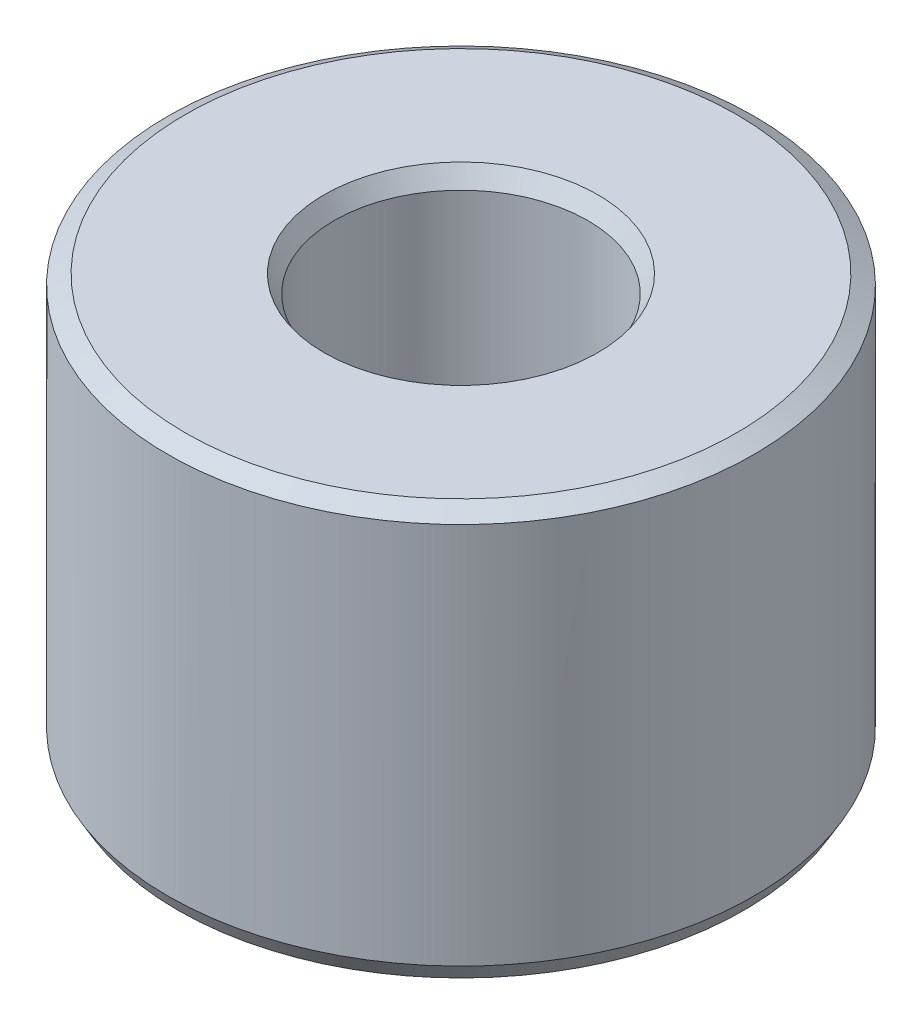
ISO-10303-21;
HEADER;
FILE_DESCRIPTION(('STEP AP214'),'2;1');
FILE_NAME('part.step','',(''),(''),'','','');
FILE_SCHEMA(('AUTOMOTIVE_DESIGN { 1 0 10303 214 1 1 1 1 }'));
ENDSEC;
DATA;
#1=APPLICATION_CONTEXT('core data for automotive mechanical design processes');
#2=APPLICATION_PROTOCOL_DEFINITION('international standard','automotive_design',2000,#1);
#3=PRODUCT_CONTEXT('',#1,'mechanical');
#4=PRODUCT('Part','Part','',(#3));
#5=PRODUCT_RELATED_PRODUCT_CATEGORY('part','',(#4));
#6=PRODUCT_DEFINITION_FORMATION('','',#4);
#7=PRODUCT_DEFINITION_CONTEXT('part definition',#1,'design');
#8=PRODUCT_DEFINITION('design','',#6,#7);
#9=PRODUCT_DEFINITION_SHAPE('','',#8);
#10=(LENGTH_UNIT() NAMED_UNIT(*) SI_UNIT(.MILLI.,.METRE.));
#11=(NAMED_UNIT(*) PLANE_ANGLE_UNIT() SI_UNIT($,.RADIAN.));
#12=(NAMED_UNIT(*) SI_UNIT($,.STERADIAN.) SOLID_ANGLE_UNIT());
#13=UNCERTAINTY_MEASURE_WITH_UNIT(LENGTH_MEASURE(1.E-05),#10,'distance_accuracy_value','');
#14=(GEOMETRIC_REPRESENTATION_CONTEXT(3) GLOBAL_UNCERTAINTY_ASSIGNED_CONTEXT((#13)) GLOBAL_UNIT_ASSIGNED_CONTEXT((#10,
#11,#12)) REPRESENTATION_CONTEXT('',''));
#15=CARTESIAN_POINT('',(0.,0.,0.));
#16=DIRECTION('',(0.,0.,1.));
#17=DIRECTION('',(1.,0.,0.));
#18=AXIS2_PLACEMENT_3D('',#15,#16,#17);
#19=CARTESIAN_POINT('',(0.,76.9031995801441,0.));
#20=DIRECTION('',(0.,-1.,0.));
#21=DIRECTION('',(0.,0.,-1.));
#22=AXIS2_PLACEMENT_3D('',#19,#20,#21);
#23=CYLINDRICAL_SURFACE('',#22,55.);
#24=CARTESIAN_POINT('',(0.,3.25785083386025,0.));
#25=DIRECTION('',(0.,1.,0.));
#26=DIRECTION('',(0.,0.,1.));
#27=AXIS2_PLACEMENT_3D('',#24,#25,#26);
#28=CIRCLE('',#27,55.);
#29=CARTESIAN_POINT('',(0.,3.25785083386025,55.));
#30=VERTEX_POINT('',#29);
#31=EDGE_CURVE('E10',#30,#30,#28,.T.);
#32=ORIENTED_EDGE('',*,*,#31,.T.);
#33=EDGE_LOOP('',(#32));
#34=FACE_BOUND('',#33,.T.);
#35=CARTESIAN_POINT('',(0.,75.0222785242352,0.));
#36=DIRECTION('',(0.,1.,0.));
#37=DIRECTION('',(0.,0.,1.));
#38=AXIS2_PLACEMENT_3D('',#35,#36,#37);
#39=CIRCLE('',#38,55.);
#40=CARTESIAN_POINT('',(0.,75.0222785242352,-55.));
#41=VERTEX_POINT('',#40);
#42=EDGE_CURVE('E50',#41,#41,#39,.F.);
#43=ORIENTED_EDGE('',*,*,#42,.T.);
#44=EDGE_LOOP('',(#43));
#45=FACE_BOUND('',#44,.T.);
#46=ADVANCED_FACE('F39',(#34,#45),#23,.T.);
#47=CARTESIAN_POINT('',(0.,76.9031995801441,0.));
#48=DIRECTION('',(0.,1.,0.));
#49=DIRECTION('',(0.,0.,1.));
#50=AXIS2_PLACEMENT_3D('',#47,#48,#49);
#51=PLANE('',#50);
#52=CARTESIAN_POINT('',(0.,76.9031995801441,0.));
#53=DIRECTION('',(0.,1.,0.));
#54=DIRECTION('',(0.,0.,1.));
#55=AXIS2_PLACEMENT_3D('',#52,#53,#54);
#56=CIRCLE('',#55,25.6864381851244);
#57=CARTESIAN_POINT('',(0.,76.9031995801441,25.6864381851244));
#58=VERTEX_POINT('',#57);
#59=EDGE_CURVE('E58',#58,#58,#56,.F.);
#60=ORIENTED_EDGE('',*,*,#59,.T.);
#61=EDGE_LOOP('',(#60));
#62=FACE_BOUND('',#61,.T.);
#63=CARTESIAN_POINT('',(0.,76.9031995801441,0.));
#64=DIRECTION('',(0.,1.,0.));
#65=DIRECTION('',(0.,0.,1.));
#66=AXIS2_PLACEMENT_3D('',#63,#64,#65);
#67=CIRCLE('',#66,51.7421491661397);
#68=CARTESIAN_POINT('',(0.,76.9031995801441,-51.7421491661397));
#69=VERTEX_POINT('',#68);
#70=EDGE_CURVE('E61',#69,#69,#67,.T.);
#71=ORIENTED_EDGE('',*,*,#70,.T.);
#72=EDGE_LOOP('',(#71));
#73=FACE_BOUND('',#72,.T.);
#74=ADVANCED_FACE('F88',(#62,#73),#51,.T.);
#75=CARTESIAN_POINT('',(0.,0.,0.));
#76=DIRECTION('',(0.,1.,0.));
#77=DIRECTION('',(0.,0.,1.));
#78=AXIS2_PLACEMENT_3D('',#75,#76,#77);
#79=PLANE('',#78);
#80=CARTESIAN_POINT('',(0.,0.,0.));
#81=DIRECTION('',(0.,1.,0.));
#82=DIRECTION('',(0.,0.,1.));
#83=AXIS2_PLACEMENT_3D('',#80,#81,#82);
#84=CIRCLE('',#83,27.0633679630758);
#85=CARTESIAN_POINT('',(0.,0.,-27.0633679630758));
#86=VERTEX_POINT('',#85);
#87=EDGE_CURVE('E51',#86,#86,#84,.T.);
#88=ORIENTED_EDGE('',*,*,#87,.T.);
#89=EDGE_LOOP('',(#88));
#90=FACE_BOUND('',#89,.T.);
#91=CARTESIAN_POINT('',(0.,0.,0.));
#92=DIRECTION('',(0.,1.,0.));
#93=DIRECTION('',(0.,0.,1.));
#94=AXIS2_PLACEMENT_3D('',#91,#92,#93);
#95=CIRCLE('',#94,53.1190789440911);
#96=CARTESIAN_POINT('',(0.,0.,53.1190789440911));
#97=VERTEX_POINT('',#96);
#98=EDGE_CURVE('E54',#97,#97,#95,.F.);
#99=ORIENTED_EDGE('',*,*,#98,.T.);
#100=EDGE_LOOP('',(#99));
#101=FACE_BOUND('',#100,.T.);
#102=ADVANCED_FACE('F83',(#90,#101),#79,.F.);
#103=CARTESIAN_POINT('',(0.,76.9031995801441,0.));
#104=DIRECTION('',(0.,-1.,0.));
#105=DIRECTION('',(0.,0.,-1.));
#106=AXIS2_PLACEMENT_3D('',#103,#104,#105);
#107=CYLINDRICAL_SURFACE('',#106,23.8055171292155);
#108=CARTESIAN_POINT('',(0.,73.6453487462838,0.));
#109=DIRECTION('',(0.,1.,0.));
#110=DIRECTION('',(0.,0.,1.));
#111=AXIS2_PLACEMENT_3D('',#108,#109,#110);
#112=CIRCLE('',#111,23.8055171292155);
#113=CARTESIAN_POINT('',(0.,73.6453487462838,23.8055171292155));
#114=VERTEX_POINT('',#113);
#115=EDGE_CURVE('E67',#114,#114,#112,.T.);
#116=ORIENTED_EDGE('',*,*,#115,.T.);
#117=EDGE_LOOP('',(#116));
#118=FACE_BOUND('',#117,.T.);
#119=CARTESIAN_POINT('',(0.,1.8809210559089,0.));
#120=DIRECTION('',(0.,1.,0.));
#121=DIRECTION('',(0.,0.,1.));
#122=AXIS2_PLACEMENT_3D('',#119,#120,#121);
#123=CIRCLE('',#122,23.8055171292155);
#124=CARTESIAN_POINT('',(0.,1.8809210559089,-23.8055171292155));
#125=VERTEX_POINT('',#124);
#126=EDGE_CURVE('E69',#125,#125,#123,.F.);
#127=ORIENTED_EDGE('',*,*,#126,.T.);
#128=EDGE_LOOP('',(#127));
#129=FACE_BOUND('',#128,.T.);
#130=ADVANCED_FACE('F71',(#118,#129),#107,.F.);
#131=CARTESIAN_POINT('',(0.,73.6453487462838,0.));
#132=DIRECTION('',(0.,1.,0.));
#133=DIRECTION('',(0.,0.,1.));
#134=AXIS2_PLACEMENT_3D('',#131,#132,#133);
#135=CONICAL_SURFACE('',#134,23.8055171292155,0.5235987755983);
#136=ORIENTED_EDGE('',*,*,#59,.F.);
#137=EDGE_LOOP('',(#136));
#138=FACE_BOUND('',#137,.T.);
#139=ORIENTED_EDGE('',*,*,#115,.F.);
#140=EDGE_LOOP('',(#139));
#141=FACE_BOUND('',#140,.T.);
#142=ADVANCED_FACE('F77',(#138,#141),#135,.F.);
#143=CARTESIAN_POINT('',(0.,0.,0.));
#144=DIRECTION('',(0.,-1.,0.));
#145=DIRECTION('',(0.,0.,-1.));
#146=AXIS2_PLACEMENT_3D('',#143,#144,#145);
#147=CONICAL_SURFACE('',#146,27.0633679630758,1.04719755119659);
#148=CARTESIAN_POINT('',(0.,1.8809210559089,-23.8055171292155));
#149=CARTESIAN_POINT('',(0.,1.86132812824318,-23.8394530754016));
#150=CARTESIAN_POINT('',(0.,1.84173520057746,-23.8733890215876));
#151=CARTESIAN_POINT('',(0.,1.80254934524603,-23.9412609139597));
#152=CARTESIAN_POINT('',(0.,1.78295641758031,-23.9751968601458));
#153=CARTESIAN_POINT('',(0.,1.74377056224887,-24.0430687525178));
#154=CARTESIAN_POINT('',(0.,1.72417763458315,-24.0770046987039));
#155=CARTESIAN_POINT('',(0.,1.68499177925172,-24.144876591076));
#156=CARTESIAN_POINT('',(0.,1.665398851586,-24.178812537262));
#157=CARTESIAN_POINT('',(0.,1.62621299625457,-24.2466844296341));
#158=CARTESIAN_POINT('',(0.,1.60662006858885,-24.2806203758201));
#159=CARTESIAN_POINT('',(0.,1.56743421325741,-24.3484922681922));
#160=CARTESIAN_POINT('',(0.,1.5478412855917,-24.3824282143783));
#161=CARTESIAN_POINT('',(0.,1.50865543026026,-24.4503001067504));
#162=CARTESIAN_POINT('',(0.,1.48906250259454,-24.4842360529364));
#163=CARTESIAN_POINT('',(0.,1.44987664726311,-24.5521079453085));
#164=CARTESIAN_POINT('',(0.,1.43028371959739,-24.5860438914946));
#165=CARTESIAN_POINT('',(0.,1.39109786426595,-24.6539157838666));
#166=CARTESIAN_POINT('',(0.,1.37150493660024,-24.6878517300527));
#167=CARTESIAN_POINT('',(0.,1.3323190812688,-24.7557236224248));
#168=CARTESIAN_POINT('',(0.,1.31272615360308,-24.7896595686108));
#169=CARTESIAN_POINT('',(0.,1.27354029827165,-24.8575314609829));
#170=CARTESIAN_POINT('',(0.,1.25394737060593,-24.8914674071689));
#171=CARTESIAN_POINT('',(0.,1.21476151527449,-24.959339299541));
#172=CARTESIAN_POINT('',(0.,1.19516858760878,-24.9932752457271));
#173=CARTESIAN_POINT('',(0.,1.15598273227734,-25.0611471380992));
#174=CARTESIAN_POINT('',(0.,1.13638980461162,-25.0950830842852));
#175=CARTESIAN_POINT('',(0.,1.09720394928019,-25.1629549766573));
#176=CARTESIAN_POINT('',(0.,1.07761102161447,-25.1968909228433));
#177=CARTESIAN_POINT('',(0.,1.03842516628304,-25.2647628152154));
#178=CARTESIAN_POINT('',(0.,1.01883223861732,-25.2986987614015));
#179=CARTESIAN_POINT('',(0.,0.979646383285883,-25.3665706537736));
#180=CARTESIAN_POINT('',(0.,0.960053455620166,-25.4005065999596));
#181=CARTESIAN_POINT('',(0.,0.920867600288731,-25.4683784923317));
#182=CARTESIAN_POINT('',(0.,0.901274672623013,-25.5023144385177));
#183=CARTESIAN_POINT('',(0.,0.862088817291577,-25.5701863308898));
#184=CARTESIAN_POINT('',(0.,0.84249588962586,-25.6041222770759));
#185=CARTESIAN_POINT('',(0.,0.803310034294425,-25.671994169448));
#186=CARTESIAN_POINT('',(0.,0.783717106628707,-25.705930115634));
#187=CARTESIAN_POINT('',(0.,0.744531251297271,-25.7738020080061));
#188=CARTESIAN_POINT('',(0.,0.724938323631553,-25.8077379541921));
#189=CARTESIAN_POINT('',(0.,0.685752468300118,-25.8756098465642));
#190=CARTESIAN_POINT('',(0.,0.666159540634401,-25.9095457927503));
#191=CARTESIAN_POINT('',(0.,0.626973685302965,-25.9774176851224));
#192=CARTESIAN_POINT('',(0.,0.607380757637247,-26.0113536313084));
#193=CARTESIAN_POINT('',(0.,0.568194902305812,-26.0792255236805));
#194=CARTESIAN_POINT('',(0.,0.548601974640095,-26.1131614698665));
#195=CARTESIAN_POINT('',(0.,0.50941611930866,-26.1810333622386));
#196=CARTESIAN_POINT('',(0.,0.489823191642941,-26.2149693084247));
#197=CARTESIAN_POINT('',(0.,0.450637336311506,-26.2828412007968));
#198=CARTESIAN_POINT('',(0.,0.431044408645789,-26.3167771469828));
#199=CARTESIAN_POINT('',(0.,0.391858553314354,-26.3846490393549));
#200=CARTESIAN_POINT('',(0.,0.372265625648635,-26.4185849855409));
#201=CARTESIAN_POINT('',(0.,0.3330797703172,-26.486456877913));
#202=CARTESIAN_POINT('',(0.,0.313486842651483,-26.5203928240991));
#203=CARTESIAN_POINT('',(0.,0.274300987320048,-26.5882647164712));
#204=CARTESIAN_POINT('',(0.,0.254708059654329,-26.6222006626572));
#205=CARTESIAN_POINT('',(0.,0.215522204322894,-26.6900725550293));
#206=CARTESIAN_POINT('',(0.,0.195929276657177,-26.7240085012153));
#207=CARTESIAN_POINT('',(0.,0.156743421325742,-26.7918803935874));
#208=CARTESIAN_POINT('',(0.,0.137150493660023,-26.8258163397735));
#209=CARTESIAN_POINT('',(0.,0.097964638328588,-26.8936882321456));
#210=CARTESIAN_POINT('',(0.,0.0783717106628706,-26.9276241783316));
#211=CARTESIAN_POINT('',(0.,0.0391858553314359,-26.9954960707037));
#212=CARTESIAN_POINT('',(0.,0.0195929276657185,-27.0294320168897));
#213=CARTESIAN_POINT('',(0.,0.,-27.0633679630758));
#214=B_SPLINE_CURVE_WITH_KNOTS('',3,(#148,#149,#150,#151,#152,#153,#154,#155,#156,#157,#158,
#159,#160,#161,#162,#163,#164,#165,#166,#167,#168,#169,#170,#171,#172,#173,#174,#175,#176,#177,
#178,#179,#180,#181,#182,#183,#184,#185,#186,#187,#188,#189,#190,#191,#192,#193,#194,#195,#196,
#197,#198,#199,#200,#201,#202,#203,#204,#205,#206,#207,#208,#209,#210,#211,#212,#213),
.UNSPECIFIED.,.F.,.F.,(4,2,2,2,2,2,2,2,2,2,2,2,2,2,2,2,2,2,2,2,2,2,2,2,2,2,2,2,2,2,2,2,4),(0.,
0.117557565994306,0.23511513198861,0.352672697982916,0.470230263977219,0.587787829971523,
0.705345395965829,0.822902961960132,0.940460527954439,1.05801809394874,1.17557565994305,
1.29313322593735,1.41069079193166,1.52824835792596,1.64580592392027,1.76336348991457,
1.88092105590888,1.99847862190318,2.11603618789749,2.23359375389179,2.35115131988609,
2.4687088858804,2.5862664518747,2.70382401786901,2.82138158386331,2.93893914985762,
3.05649671585192,3.17405428184623,3.29161184784053,3.40916941383484,3.52672697982914,
3.64428454582345,3.76184211181775),.UNSPECIFIED.);
#215=EDGE_CURVE('BSEAM73',#125,#86,#214,.T.);
#216=ORIENTED_EDGE('',*,*,#126,.F.);
#217=ORIENTED_EDGE('',*,*,#87,.F.);
#218=ORIENTED_EDGE('',*,*,#215,.T.);
#219=ORIENTED_EDGE('',*,*,#215,.F.);
#220=EDGE_LOOP('',(#216,#218,#217,#219));
#221=FACE_BOUND('',#220,.T.);
#222=ADVANCED_FACE('F73',(#221),#147,.F.);
#223=CARTESIAN_POINT('',(0.,3.25785083386025,0.));
#224=DIRECTION('',(0.,1.,0.));
#225=DIRECTION('',(0.,0.,1.));
#226=AXIS2_PLACEMENT_3D('',#223,#224,#225);
#227=CONICAL_SURFACE('',#226,55.,0.523598775598302);
#228=ORIENTED_EDGE('',*,*,#98,.F.);
#229=EDGE_LOOP('',(#228));
#230=FACE_BOUND('',#229,.T.);
#231=ORIENTED_EDGE('',*,*,#31,.F.);
#232=EDGE_LOOP('',(#231));
#233=FACE_BOUND('',#232,.T.);
#234=ADVANCED_FACE('F76',(#230,#233),#227,.T.);
#235=CARTESIAN_POINT('',(0.,76.9031995801441,0.));
#236=DIRECTION('',(0.,-1.,0.));
#237=DIRECTION('',(0.,0.,-1.));
#238=AXIS2_PLACEMENT_3D('',#235,#236,#237);
#239=CONICAL_SURFACE('',#238,51.7421491661397,1.04719755119659);
#240=CARTESIAN_POINT('',(0.,75.0222785242352,-55.));
#241=CARTESIAN_POINT('',(0.,75.0418714519009,-54.966064053814));
#242=CARTESIAN_POINT('',(0.,75.0614643795666,-54.9321281076279));
#243=CARTESIAN_POINT('',(0.,75.1006502348981,-54.8642562152558));
#244=CARTESIAN_POINT('',(0.,75.1202431625638,-54.8303202690698));
#245=CARTESIAN_POINT('',(0.,75.1594290178952,-54.7624483766977));
#246=CARTESIAN_POINT('',(0.,75.1790219455609,-54.7285124305117));
#247=CARTESIAN_POINT('',(0.,75.2182078008923,-54.6606405381396));
#248=CARTESIAN_POINT('',(0.,75.2378007285581,-54.6267045919535));
#249=CARTESIAN_POINT('',(0.,75.2769865838895,-54.5588326995814));
#250=CARTESIAN_POINT('',(0.,75.2965795115552,-54.5248967533954));
#251=CARTESIAN_POINT('',(0.,75.3357653668867,-54.4570248610233));
#252=CARTESIAN_POINT('',(0.,75.3553582945524,-54.4230889148373));
#253=CARTESIAN_POINT('',(0.,75.3945441498838,-54.3552170224652));
#254=CARTESIAN_POINT('',(0.,75.4141370775495,-54.3212810762791));
#255=CARTESIAN_POINT('',(0.,75.453322932881,-54.253409183907));
#256=CARTESIAN_POINT('',(0.,75.4729158605467,-54.219473237721));
#257=CARTESIAN_POINT('',(0.,75.5121017158781,-54.1516013453489));
#258=CARTESIAN_POINT('',(0.,75.5316946435438,-54.1176653991629));
#259=CARTESIAN_POINT('',(0.,75.5708804988753,-54.0497935067908));
#260=CARTESIAN_POINT('',(0.,75.590473426541,-54.0158575606047));
#261=CARTESIAN_POINT('',(0.,75.6296592818724,-53.9479856682326));
#262=CARTESIAN_POINT('',(0.,75.6492522095381,-53.9140497220466));
#263=CARTESIAN_POINT('',(0.,75.6884380648696,-53.8461778296745));
#264=CARTESIAN_POINT('',(0.,75.7080309925353,-53.8122418834885));
#265=CARTESIAN_POINT('',(0.,75.7472168478667,-53.7443699911164));
#266=CARTESIAN_POINT('',(0.,75.7668097755325,-53.7104340449303));
#267=CARTESIAN_POINT('',(0.,75.8059956308639,-53.6425621525582));
#268=CARTESIAN_POINT('',(0.,75.8255885585296,-53.6086262063722));
#269=CARTESIAN_POINT('',(0.,75.864774413861,-53.5407543140001));
#270=CARTESIAN_POINT('',(0.,75.8843673415267,-53.5068183678141));
#271=CARTESIAN_POINT('',(0.,75.9235531968582,-53.438946475442));
#272=CARTESIAN_POINT('',(0.,75.9431461245239,-53.4050105292559));
#273=CARTESIAN_POINT('',(0.,75.9823319798553,-53.3371386368838));
#274=CARTESIAN_POINT('',(0.,76.0019249075211,-53.3032026906978));
#275=CARTESIAN_POINT('',(0.,76.0411107628525,-53.2353307983257));
#276=CARTESIAN_POINT('',(0.,76.0607036905182,-53.2013948521397));
#277=CARTESIAN_POINT('',(0.,76.0998895458496,-53.1335229597676));
#278=CARTESIAN_POINT('',(0.,76.1194824735153,-53.0995870135815));
#279=CARTESIAN_POINT('',(0.,76.1586683288468,-53.0317151212094));
#280=CARTESIAN_POINT('',(0.,76.1782612565125,-52.9977791750234));
#281=CARTESIAN_POINT('',(0.,76.217447111844,-52.9299072826513));
#282=CARTESIAN_POINT('',(0.,76.2370400395097,-52.8959713364653));
#283=CARTESIAN_POINT('',(0.,76.2762258948411,-52.8280994440932));
#284=CARTESIAN_POINT('',(0.,76.2958188225068,-52.7941634979071));
#285=CARTESIAN_POINT('',(0.,76.3350046778383,-52.726291605535));
#286=CARTESIAN_POINT('',(0.,76.354597605504,-52.692355659349));
#287=CARTESIAN_POINT('',(0.,76.3937834608354,-52.6244837669769));
#288=CARTESIAN_POINT('',(0.,76.4133763885011,-52.5905478207909));
#289=CARTESIAN_POINT('',(0.,76.4525622438326,-52.5226759284188));
#290=CARTESIAN_POINT('',(0.,76.4721551714983,-52.4887399822327));
#291=CARTESIAN_POINT('',(0.,76.5113410268297,-52.4208680898606));
#292=CARTESIAN_POINT('',(0.,76.5309339544954,-52.3869321436746));
#293=CARTESIAN_POINT('',(0.,76.5701198098269,-52.3190602513025));
#294=CARTESIAN_POINT('',(0.,76.5897127374926,-52.2851243051165));
#295=CARTESIAN_POINT('',(0.,76.628898592824,-52.2172524127444));
#296=CARTESIAN_POINT('',(0.,76.6484915204897,-52.1833164665583));
#297=CARTESIAN_POINT('',(0.,76.6876773758212,-52.1154445741862));
#298=CARTESIAN_POINT('',(0.,76.7072703034869,-52.0815086280002));
#299=CARTESIAN_POINT('',(0.,76.7464561588183,-52.0136367356281));
#300=CARTESIAN_POINT('',(0.,76.766049086484,-51.979700789442));
#301=CARTESIAN_POINT('',(0.,76.8052349418155,-51.91182889707));
#302=CARTESIAN_POINT('',(0.,76.8248278694812,-51.8778929508839));
#303=CARTESIAN_POINT('',(0.,76.8640137248126,-51.8100210585118));
#304=CARTESIAN_POINT('',(0.,76.8836066524784,-51.7760851123258));
#305=CARTESIAN_POINT('',(0.,76.9031995801441,-51.7421491661397));
#306=B_SPLINE_CURVE_WITH_KNOTS('',3,(#240,#241,#242,#243,#244,#245,#246,#247,#248,#249,#250,
#251,#252,#253,#254,#255,#256,#257,#258,#259,#260,#261,#262,#263,#264,#265,#266,#267,#268,#269,
#270,#271,#272,#273,#274,#275,#276,#277,#278,#279,#280,#281,#282,#283,#284,#285,#286,#287,#288,
#289,#290,#291,#292,#293,#294,#295,#296,#297,#298,#299,#300,#301,#302,#303,#304,#305),
.UNSPECIFIED.,.F.,.F.,(4,2,2,2,2,2,2,2,2,2,2,2,2,2,2,2,2,2,2,2,2,2,2,2,2,2,2,2,2,2,2,2,4),(0.,
0.117557565994311,0.235115131988615,0.352672697982913,0.470230263977225,0.587787829971529,
0.705345395965833,0.822902961960144,0.940460527954442,1.05801809394875,1.17557565994306,
1.29313322593736,1.41069079193167,1.52824835792597,1.64580592392027,1.76336348991458,
1.88092105590888,1.99847862190319,2.11603618789749,2.2335937538918,2.35115131988611,
2.46870888588041,2.58626645187471,2.70382401786902,2.82138158386333,2.93893914985763,
3.05649671585194,3.17405428184624,3.29161184784054,3.40916941383485,3.52672697982916,
3.64428454582346,3.76184211181777),.UNSPECIFIED.);
#307=EDGE_CURVE('BSEAM45',#41,#69,#306,.T.);
#308=ORIENTED_EDGE('',*,*,#42,.F.);
#309=ORIENTED_EDGE('',*,*,#70,.F.);
#310=ORIENTED_EDGE('',*,*,#307,.T.);
#311=ORIENTED_EDGE('',*,*,#307,.F.);
#312=EDGE_LOOP('',(#308,#310,#309,#311));
#313=FACE_BOUND('',#312,.T.);
#314=ADVANCED_FACE('F45',(#313),#239,.T.);
#315=CLOSED_SHELL('',(#46,#74,#102,#130,#142,#222,#234,#314));
#316=MANIFOLD_SOLID_BREP('B2',#315);
#317=ADVANCED_BREP_SHAPE_REPRESENTATION('',(#18,#316),#14);
#318=SHAPE_DEFINITION_REPRESENTATION(#9,#317);
ENDSEC;
END-ISO-10303-21;
